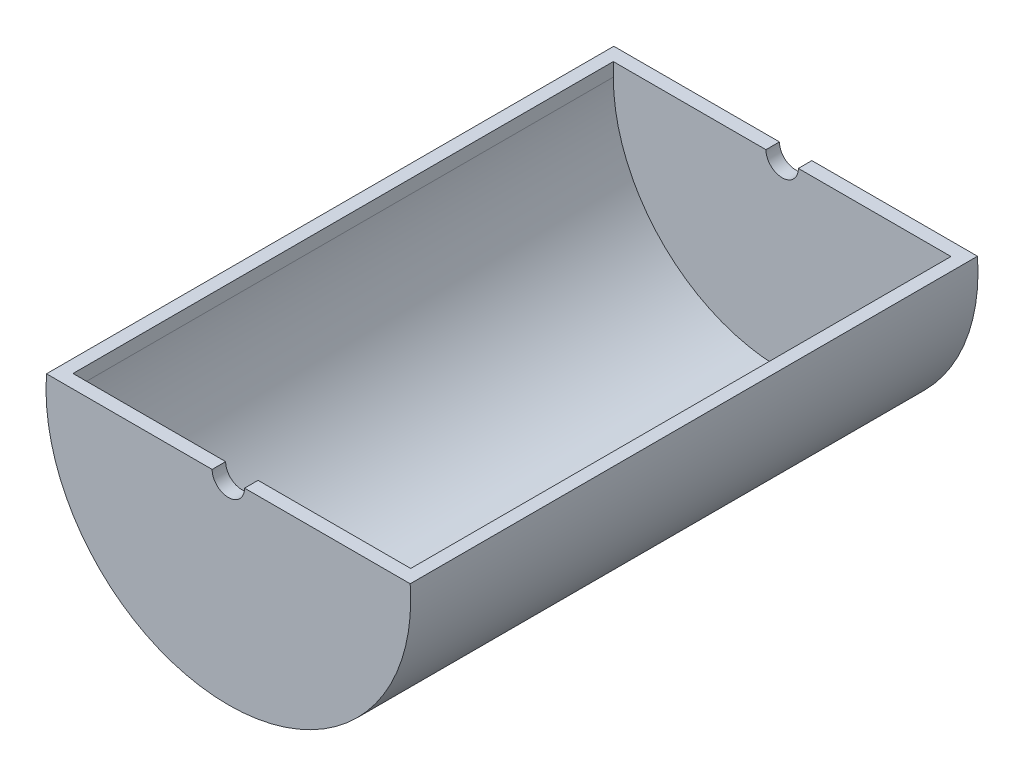
ISO-10303-21;
HEADER;
FILE_DESCRIPTION(('STEP AP214'),'2;1');
FILE_NAME('part.step','',(''),(''),'','','');
FILE_SCHEMA(('AUTOMOTIVE_DESIGN { 1 0 10303 214 1 1 1 1 }'));
ENDSEC;
DATA;
#1=APPLICATION_CONTEXT('core data for automotive mechanical design processes');
#2=APPLICATION_PROTOCOL_DEFINITION('international standard','automotive_design',2000,#1);
#3=PRODUCT_CONTEXT('',#1,'mechanical');
#4=PRODUCT('Part','Part','',(#3));
#5=PRODUCT_RELATED_PRODUCT_CATEGORY('part','',(#4));
#6=PRODUCT_DEFINITION_FORMATION('','',#4);
#7=PRODUCT_DEFINITION_CONTEXT('part definition',#1,'design');
#8=PRODUCT_DEFINITION('design','',#6,#7);
#9=PRODUCT_DEFINITION_SHAPE('','',#8);
#10=(LENGTH_UNIT() NAMED_UNIT(*) SI_UNIT(.MILLI.,.METRE.));
#11=(NAMED_UNIT(*) PLANE_ANGLE_UNIT() SI_UNIT($,.RADIAN.));
#12=(NAMED_UNIT(*) SI_UNIT($,.STERADIAN.) SOLID_ANGLE_UNIT());
#13=UNCERTAINTY_MEASURE_WITH_UNIT(LENGTH_MEASURE(1.E-05),#10,'distance_accuracy_value','');
#14=(GEOMETRIC_REPRESENTATION_CONTEXT(3) GLOBAL_UNCERTAINTY_ASSIGNED_CONTEXT((#13)) GLOBAL_UNIT_ASSIGNED_CONTEXT((#10,
#11,#12)) REPRESENTATION_CONTEXT('',''));
#15=CARTESIAN_POINT('',(0.,0.,0.));
#16=DIRECTION('',(0.,0.,1.));
#17=DIRECTION('',(1.,0.,0.));
#18=AXIS2_PLACEMENT_3D('',#15,#16,#17);
#19=CARTESIAN_POINT('',(125.,10.,210.));
#20=DIRECTION('',(1.,0.,0.));
#21=DIRECTION('',(0.,1.,0.));
#22=AXIS2_PLACEMENT_3D('',#19,#20,#21);
#23=PLANE('',#22);
#24=DIRECTION('',(0.,0.,-1.));
#25=VECTOR('',#24,1.);
#26=CARTESIAN_POINT('',(125.,10.,210.));
#27=LINE('',#26,#25);
#28=CARTESIAN_POINT('',(125.,10.,200.));
#29=VERTEX_POINT('',#28);
#30=CARTESIAN_POINT('',(125.,10.,-200.));
#31=VERTEX_POINT('',#30);
#32=EDGE_CURVE('E52',#29,#31,#27,.T.);
#33=ORIENTED_EDGE('',*,*,#32,.T.);
#34=DIRECTION('',(0.,1.,0.));
#35=VECTOR('',#34,1.);
#36=CARTESIAN_POINT('',(125.,1.73472347597681E-13,-200.));
#37=LINE('',#36,#35);
#38=CARTESIAN_POINT('',(125.,0.,-200.));
#39=VERTEX_POINT('',#38);
#40=EDGE_CURVE('E59',#39,#31,#37,.T.);
#41=ORIENTED_EDGE('',*,*,#40,.F.);
#42=DIRECTION('',(0.,0.,-1.));
#43=VECTOR('',#42,1.);
#44=CARTESIAN_POINT('',(125.,0.,210.));
#45=LINE('',#44,#43);
#46=CARTESIAN_POINT('',(125.,0.,200.));
#47=VERTEX_POINT('',#46);
#48=EDGE_CURVE('E224',#47,#39,#45,.T.);
#49=ORIENTED_EDGE('',*,*,#48,.F.);
#50=DIRECTION('',(0.,-1.,0.));
#51=VECTOR('',#50,1.);
#52=CARTESIAN_POINT('',(125.,1.73472347597681E-13,200.));
#53=LINE('',#52,#51);
#54=EDGE_CURVE('E176',#29,#47,#53,.T.);
#55=ORIENTED_EDGE('',*,*,#54,.F.);
#56=EDGE_LOOP('',(#33,#41,#49,#55));
#57=FACE_BOUND('',#56,.T.);
#58=ADVANCED_FACE('F43',(#57),#23,.F.);
#59=CARTESIAN_POINT('',(0.,0.,210.));
#60=DIRECTION('',(0.,0.,-1.));
#61=DIRECTION('',(-1.,0.,0.));
#62=AXIS2_PLACEMENT_3D('',#59,#60,#61);
#63=CYLINDRICAL_SURFACE('',#62,125.);
#64=ORIENTED_EDGE('',*,*,#48,.T.);
#65=CARTESIAN_POINT('',(0.,0.,-200.));
#66=DIRECTION('',(0.,0.,1.));
#67=DIRECTION('',(1.,0.,0.));
#68=AXIS2_PLACEMENT_3D('',#65,#66,#67);
#69=CIRCLE('',#68,125.);
#70=CARTESIAN_POINT('',(-125.,0.,-200.));
#71=VERTEX_POINT('',#70);
#72=EDGE_CURVE('E66',#71,#39,#69,.T.);
#73=ORIENTED_EDGE('',*,*,#72,.F.);
#74=DIRECTION('',(0.,0.,-1.));
#75=VECTOR('',#74,1.);
#76=CARTESIAN_POINT('',(-125.,0.,210.));
#77=LINE('',#76,#75);
#78=CARTESIAN_POINT('',(-125.,0.,200.));
#79=VERTEX_POINT('',#78);
#80=EDGE_CURVE('E221',#79,#71,#77,.T.);
#81=ORIENTED_EDGE('',*,*,#80,.F.);
#82=CARTESIAN_POINT('',(0.,0.,200.));
#83=DIRECTION('',(0.,0.,1.));
#84=DIRECTION('',(1.,0.,0.));
#85=AXIS2_PLACEMENT_3D('',#82,#83,#84);
#86=CIRCLE('',#85,125.);
#87=EDGE_CURVE('E179',#79,#47,#86,.T.);
#88=ORIENTED_EDGE('',*,*,#87,.T.);
#89=EDGE_LOOP('',(#64,#73,#81,#88));
#90=FACE_BOUND('',#89,.T.);
#91=ADVANCED_FACE('F252',(#90),#63,.F.);
#92=CARTESIAN_POINT('',(-125.,0.,210.));
#93=DIRECTION('',(-1.,0.,0.));
#94=DIRECTION('',(0.,0.,1.));
#95=AXIS2_PLACEMENT_3D('',#92,#93,#94);
#96=PLANE('',#95);
#97=ORIENTED_EDGE('',*,*,#80,.T.);
#98=DIRECTION('',(0.,-1.,0.));
#99=VECTOR('',#98,1.);
#100=CARTESIAN_POINT('',(-125.,0.,-200.));
#101=LINE('',#100,#99);
#102=CARTESIAN_POINT('',(-125.,10.,-200.));
#103=VERTEX_POINT('',#102);
#104=EDGE_CURVE('E151',#103,#71,#101,.T.);
#105=ORIENTED_EDGE('',*,*,#104,.F.);
#106=DIRECTION('',(0.,0.,-1.));
#107=VECTOR('',#106,1.);
#108=CARTESIAN_POINT('',(-125.,10.,210.));
#109=LINE('',#108,#107);
#110=CARTESIAN_POINT('',(-125.,10.,200.));
#111=VERTEX_POINT('',#110);
#112=EDGE_CURVE('E217',#111,#103,#109,.T.);
#113=ORIENTED_EDGE('',*,*,#112,.F.);
#114=DIRECTION('',(0.,1.,0.));
#115=VECTOR('',#114,1.);
#116=CARTESIAN_POINT('',(-125.,0.,200.));
#117=LINE('',#116,#115);
#118=EDGE_CURVE('E163',#79,#111,#117,.T.);
#119=ORIENTED_EDGE('',*,*,#118,.F.);
#120=EDGE_LOOP('',(#97,#105,#113,#119));
#121=FACE_BOUND('',#120,.T.);
#122=ADVANCED_FACE('F250',(#121),#96,.F.);
#123=CARTESIAN_POINT('',(0.,0.,210.));
#124=DIRECTION('',(0.,0.,-1.));
#125=DIRECTION('',(-1.,0.,0.));
#126=AXIS2_PLACEMENT_3D('',#123,#124,#125);
#127=CYLINDRICAL_SURFACE('',#126,135.);
#128=CARTESIAN_POINT('',(0.,0.,-210.));
#129=DIRECTION('',(0.,0.,1.));
#130=DIRECTION('',(1.,0.,0.));
#131=AXIS2_PLACEMENT_3D('',#128,#129,#130);
#132=CIRCLE('',#131,135.);
#133=CARTESIAN_POINT('',(-134.629120178363,10.,-210.));
#134=VERTEX_POINT('',#133);
#135=CARTESIAN_POINT('',(134.629120178363,10.,-210.));
#136=VERTEX_POINT('',#135);
#137=EDGE_CURVE('E194',#134,#136,#132,.T.);
#138=ORIENTED_EDGE('',*,*,#137,.T.);
#139=DIRECTION('',(0.,0.,-1.));
#140=VECTOR('',#139,1.);
#141=CARTESIAN_POINT('',(134.629120178363,10.,210.));
#142=LINE('',#141,#140);
#143=CARTESIAN_POINT('',(134.629120178363,10.,210.));
#144=VERTEX_POINT('',#143);
#145=EDGE_CURVE('E11',#144,#136,#142,.T.);
#146=ORIENTED_EDGE('',*,*,#145,.F.);
#147=CARTESIAN_POINT('',(0.,0.,210.));
#148=DIRECTION('',(0.,0.,1.));
#149=DIRECTION('',(1.,0.,0.));
#150=AXIS2_PLACEMENT_3D('',#147,#148,#149);
#151=CIRCLE('',#150,135.);
#152=CARTESIAN_POINT('',(-134.629120178363,10.,210.));
#153=VERTEX_POINT('',#152);
#154=EDGE_CURVE('E195',#153,#144,#151,.T.);
#155=ORIENTED_EDGE('',*,*,#154,.F.);
#156=DIRECTION('',(0.,0.,-1.));
#157=VECTOR('',#156,1.);
#158=CARTESIAN_POINT('',(-134.629120178363,10.,210.));
#159=LINE('',#158,#157);
#160=EDGE_CURVE('E206',#153,#134,#159,.T.);
#161=ORIENTED_EDGE('',*,*,#160,.T.);
#162=EDGE_LOOP('',(#138,#146,#155,#161));
#163=FACE_BOUND('',#162,.T.);
#164=ADVANCED_FACE('F45',(#163),#127,.T.);
#165=CARTESIAN_POINT('',(125.,10.,210.));
#166=DIRECTION('',(0.,-1.,0.));
#167=DIRECTION('',(0.,0.,-1.));
#168=AXIS2_PLACEMENT_3D('',#165,#166,#167);
#169=PLANE('',#168);
#170=DIRECTION('',(-1.,0.,0.));
#171=VECTOR('',#170,1.);
#172=CARTESIAN_POINT('',(125.,10.,-210.));
#173=LINE('',#172,#171);
#174=CARTESIAN_POINT('',(12.,10.,-210.));
#175=VERTEX_POINT('',#174);
#176=EDGE_CURVE('E136',#136,#175,#173,.T.);
#177=ORIENTED_EDGE('',*,*,#176,.T.);
#178=DIRECTION('',(0.,0.,-1.));
#179=VECTOR('',#178,1.);
#180=CARTESIAN_POINT('',(12.,10.,-200.));
#181=LINE('',#180,#179);
#182=CARTESIAN_POINT('',(12.,10.,-200.));
#183=VERTEX_POINT('',#182);
#184=EDGE_CURVE('E134',#183,#175,#181,.T.);
#185=ORIENTED_EDGE('',*,*,#184,.F.);
#186=DIRECTION('',(-1.,0.,0.));
#187=VECTOR('',#186,1.);
#188=CARTESIAN_POINT('',(0.,10.,-200.));
#189=LINE('',#188,#187);
#190=EDGE_CURVE('E123',#31,#183,#189,.T.);
#191=ORIENTED_EDGE('',*,*,#190,.F.);
#192=ORIENTED_EDGE('',*,*,#32,.F.);
#193=DIRECTION('',(1.,0.,0.));
#194=VECTOR('',#193,1.);
#195=CARTESIAN_POINT('',(0.,10.,200.));
#196=LINE('',#195,#194);
#197=CARTESIAN_POINT('',(12.,10.,200.));
#198=VERTEX_POINT('',#197);
#199=EDGE_CURVE('E173',#198,#29,#196,.T.);
#200=ORIENTED_EDGE('',*,*,#199,.F.);
#201=DIRECTION('',(0.,0.,1.));
#202=VECTOR('',#201,1.);
#203=CARTESIAN_POINT('',(12.,10.,200.));
#204=LINE('',#203,#202);
#205=CARTESIAN_POINT('',(12.,10.,210.));
#206=VERTEX_POINT('',#205);
#207=EDGE_CURVE('E183',#198,#206,#204,.T.);
#208=ORIENTED_EDGE('',*,*,#207,.T.);
#209=DIRECTION('',(-1.,0.,0.));
#210=VECTOR('',#209,1.);
#211=CARTESIAN_POINT('',(125.,10.,210.));
#212=LINE('',#211,#210);
#213=EDGE_CURVE('E199',#144,#206,#212,.T.);
#214=ORIENTED_EDGE('',*,*,#213,.F.);
#215=ORIENTED_EDGE('',*,*,#145,.T.);
#216=EDGE_LOOP('',(#177,#185,#191,#192,#200,#208,#214,#215));
#217=FACE_BOUND('',#216,.T.);
#218=ADVANCED_FACE('F135',(#217),#169,.F.);
#219=CARTESIAN_POINT('',(-134.629120178363,10.,210.));
#220=DIRECTION('',(0.,-1.,0.));
#221=DIRECTION('',(0.,0.,-1.));
#222=AXIS2_PLACEMENT_3D('',#219,#220,#221);
#223=PLANE('',#222);
#224=DIRECTION('',(-1.,0.,0.));
#225=VECTOR('',#224,1.);
#226=CARTESIAN_POINT('',(-134.629120178363,10.,-210.));
#227=LINE('',#226,#225);
#228=CARTESIAN_POINT('',(-12.,10.,-210.));
#229=VERTEX_POINT('',#228);
#230=EDGE_CURVE('E200',#229,#134,#227,.T.);
#231=ORIENTED_EDGE('',*,*,#230,.T.);
#232=ORIENTED_EDGE('',*,*,#160,.F.);
#233=DIRECTION('',(-1.,0.,0.));
#234=VECTOR('',#233,1.);
#235=CARTESIAN_POINT('',(-134.629120178363,10.,210.));
#236=LINE('',#235,#234);
#237=CARTESIAN_POINT('',(-12.,10.,210.));
#238=VERTEX_POINT('',#237);
#239=EDGE_CURVE('E203',#238,#153,#236,.T.);
#240=ORIENTED_EDGE('',*,*,#239,.F.);
#241=DIRECTION('',(0.,0.,1.));
#242=VECTOR('',#241,1.);
#243=CARTESIAN_POINT('',(-12.,10.,200.));
#244=LINE('',#243,#242);
#245=CARTESIAN_POINT('',(-12.,10.,200.));
#246=VERTEX_POINT('',#245);
#247=EDGE_CURVE('E190',#246,#238,#244,.T.);
#248=ORIENTED_EDGE('',*,*,#247,.F.);
#249=DIRECTION('',(1.,0.,0.));
#250=VECTOR('',#249,1.);
#251=CARTESIAN_POINT('',(0.,10.,200.));
#252=LINE('',#251,#250);
#253=EDGE_CURVE('E167',#111,#246,#252,.T.);
#254=ORIENTED_EDGE('',*,*,#253,.F.);
#255=ORIENTED_EDGE('',*,*,#112,.T.);
#256=DIRECTION('',(-1.,0.,0.));
#257=VECTOR('',#256,1.);
#258=CARTESIAN_POINT('',(0.,10.,-200.));
#259=LINE('',#258,#257);
#260=CARTESIAN_POINT('',(-12.,10.,-200.));
#261=VERTEX_POINT('',#260);
#262=EDGE_CURVE('E148',#261,#103,#259,.T.);
#263=ORIENTED_EDGE('',*,*,#262,.F.);
#264=DIRECTION('',(0.,0.,-1.));
#265=VECTOR('',#264,1.);
#266=CARTESIAN_POINT('',(-12.,10.,-200.));
#267=LINE('',#266,#265);
#268=EDGE_CURVE('E142',#261,#229,#267,.T.);
#269=ORIENTED_EDGE('',*,*,#268,.T.);
#270=EDGE_LOOP('',(#231,#232,#240,#248,#254,#255,#263,#269));
#271=FACE_BOUND('',#270,.T.);
#272=ADVANCED_FACE('F247',(#271),#223,.F.);
#273=CARTESIAN_POINT('',(0.,0.,210.));
#274=DIRECTION('',(0.,0.,1.));
#275=DIRECTION('',(1.,0.,0.));
#276=AXIS2_PLACEMENT_3D('',#273,#274,#275);
#277=PLANE('',#276);
#278=CARTESIAN_POINT('',(0.,10.,210.));
#279=DIRECTION('',(0.,0.,1.));
#280=DIRECTION('',(1.,0.,0.));
#281=AXIS2_PLACEMENT_3D('',#278,#279,#280);
#282=CIRCLE('',#281,12.);
#283=EDGE_CURVE('E141',#238,#206,#282,.T.);
#284=ORIENTED_EDGE('',*,*,#283,.F.);
#285=ORIENTED_EDGE('',*,*,#239,.T.);
#286=ORIENTED_EDGE('',*,*,#154,.T.);
#287=ORIENTED_EDGE('',*,*,#213,.T.);
#288=EDGE_LOOP('',(#284,#285,#286,#287));
#289=FACE_BOUND('',#288,.T.);
#290=ADVANCED_FACE('F238',(#289),#277,.T.);
#291=CARTESIAN_POINT('',(0.,0.,-210.));
#292=DIRECTION('',(0.,0.,1.));
#293=DIRECTION('',(1.,0.,0.));
#294=AXIS2_PLACEMENT_3D('',#291,#292,#293);
#295=PLANE('',#294);
#296=ORIENTED_EDGE('',*,*,#137,.F.);
#297=ORIENTED_EDGE('',*,*,#230,.F.);
#298=CARTESIAN_POINT('',(0.,10.,-210.));
#299=DIRECTION('',(0.,0.,1.));
#300=DIRECTION('',(1.,0.,0.));
#301=AXIS2_PLACEMENT_3D('',#298,#299,#300);
#302=CIRCLE('',#301,12.);
#303=EDGE_CURVE('E158',#229,#175,#302,.T.);
#304=ORIENTED_EDGE('',*,*,#303,.T.);
#305=ORIENTED_EDGE('',*,*,#176,.F.);
#306=EDGE_LOOP('',(#296,#297,#304,#305));
#307=FACE_BOUND('',#306,.T.);
#308=ADVANCED_FACE('F245',(#307),#295,.F.);
#309=CARTESIAN_POINT('',(0.,10.,200.));
#310=DIRECTION('',(0.,0.,1.));
#311=DIRECTION('',(1.,0.,0.));
#312=AXIS2_PLACEMENT_3D('',#309,#310,#311);
#313=CYLINDRICAL_SURFACE('',#312,12.);
#314=ORIENTED_EDGE('',*,*,#283,.T.);
#315=ORIENTED_EDGE('',*,*,#207,.F.);
#316=CARTESIAN_POINT('',(0.,10.,200.));
#317=DIRECTION('',(0.,0.,1.));
#318=DIRECTION('',(1.,0.,0.));
#319=AXIS2_PLACEMENT_3D('',#316,#317,#318);
#320=CIRCLE('',#319,12.);
#321=EDGE_CURVE('E170',#246,#198,#320,.T.);
#322=ORIENTED_EDGE('',*,*,#321,.F.);
#323=ORIENTED_EDGE('',*,*,#247,.T.);
#324=EDGE_LOOP('',(#314,#315,#322,#323));
#325=FACE_BOUND('',#324,.T.);
#326=ADVANCED_FACE('F235',(#325),#313,.F.);
#327=CARTESIAN_POINT('',(0.,10.,200.));
#328=DIRECTION('',(0.,0.,1.));
#329=DIRECTION('',(1.,0.,0.));
#330=AXIS2_PLACEMENT_3D('',#327,#328,#329);
#331=PLANE('',#330);
#332=ORIENTED_EDGE('',*,*,#118,.T.);
#333=ORIENTED_EDGE('',*,*,#253,.T.);
#334=ORIENTED_EDGE('',*,*,#321,.T.);
#335=ORIENTED_EDGE('',*,*,#199,.T.);
#336=ORIENTED_EDGE('',*,*,#54,.T.);
#337=ORIENTED_EDGE('',*,*,#87,.F.);
#338=EDGE_LOOP('',(#332,#333,#334,#335,#336,#337));
#339=FACE_BOUND('',#338,.T.);
#340=ADVANCED_FACE('F231',(#339),#331,.F.);
#341=CARTESIAN_POINT('',(0.,10.,-200.));
#342=DIRECTION('',(0.,0.,-1.));
#343=DIRECTION('',(-1.,0.,0.));
#344=AXIS2_PLACEMENT_3D('',#341,#342,#343);
#345=CYLINDRICAL_SURFACE('',#344,12.);
#346=ORIENTED_EDGE('',*,*,#303,.F.);
#347=ORIENTED_EDGE('',*,*,#268,.F.);
#348=CARTESIAN_POINT('',(0.,10.,-200.));
#349=DIRECTION('',(0.,0.,1.));
#350=DIRECTION('',(1.,0.,0.));
#351=AXIS2_PLACEMENT_3D('',#348,#349,#350);
#352=CIRCLE('',#351,12.);
#353=EDGE_CURVE('E128',#261,#183,#352,.T.);
#354=ORIENTED_EDGE('',*,*,#353,.T.);
#355=ORIENTED_EDGE('',*,*,#184,.T.);
#356=EDGE_LOOP('',(#346,#347,#354,#355));
#357=FACE_BOUND('',#356,.T.);
#358=ADVANCED_FACE('F144',(#357),#345,.F.);
#359=CARTESIAN_POINT('',(0.,0.,-200.));
#360=DIRECTION('',(0.,0.,1.));
#361=DIRECTION('',(1.,0.,0.));
#362=AXIS2_PLACEMENT_3D('',#359,#360,#361);
#363=PLANE('',#362);
#364=ORIENTED_EDGE('',*,*,#72,.T.);
#365=ORIENTED_EDGE('',*,*,#40,.T.);
#366=ORIENTED_EDGE('',*,*,#190,.T.);
#367=ORIENTED_EDGE('',*,*,#353,.F.);
#368=ORIENTED_EDGE('',*,*,#262,.T.);
#369=ORIENTED_EDGE('',*,*,#104,.T.);
#370=EDGE_LOOP('',(#364,#365,#366,#367,#368,#369));
#371=FACE_BOUND('',#370,.T.);
#372=ADVANCED_FACE('F125',(#371),#363,.T.);
#373=CLOSED_SHELL('',(#58,#91,#122,#164,#218,#272,#290,#308,#326,#340,#358,#372));
#374=MANIFOLD_SOLID_BREP('B2',#373);
#375=ADVANCED_BREP_SHAPE_REPRESENTATION('',(#18,#374),#14);
#376=SHAPE_DEFINITION_REPRESENTATION(#9,#375);
ENDSEC;
END-ISO-10303-21;
